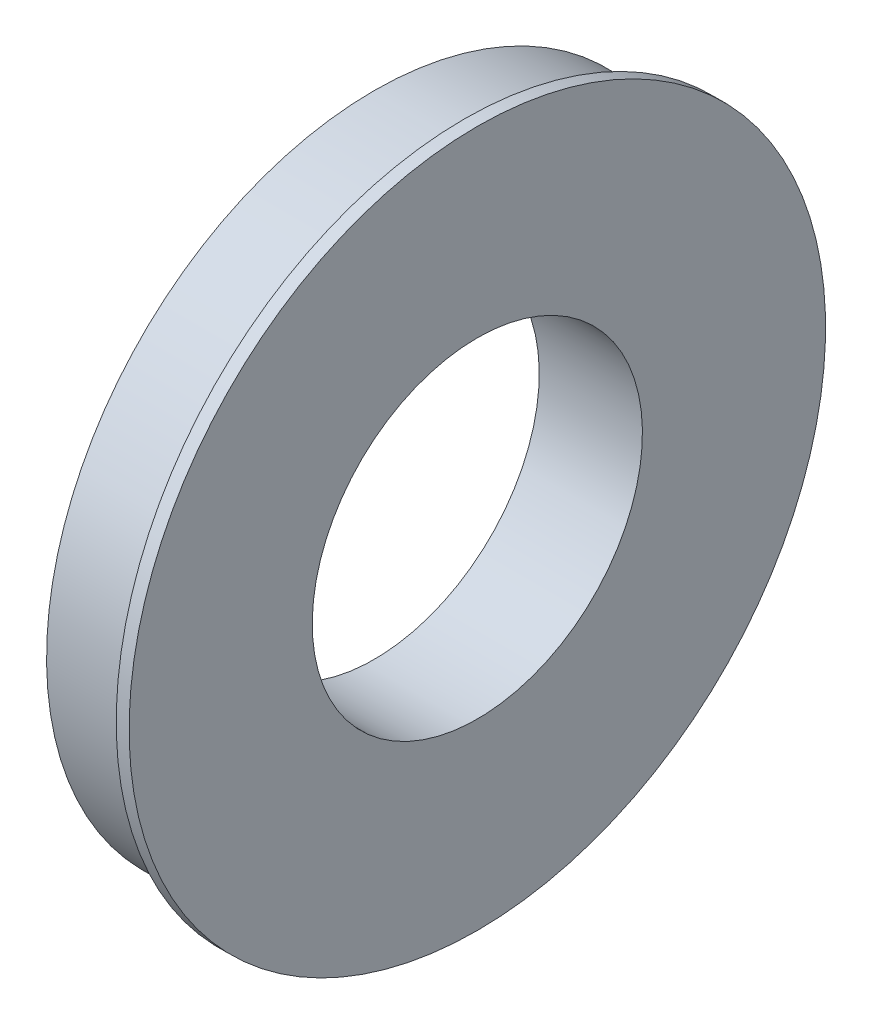
ISO-10303-21;
HEADER;
FILE_DESCRIPTION(('STEP AP214'),'2;1');
FILE_NAME('part.step','',(''),(''),'','','');
FILE_SCHEMA(('AUTOMOTIVE_DESIGN { 1 0 10303 214 1 1 1 1 }'));
ENDSEC;
DATA;
#1=APPLICATION_CONTEXT('core data for automotive mechanical design processes');
#2=APPLICATION_PROTOCOL_DEFINITION('international standard','automotive_design',2000,#1);
#3=PRODUCT_CONTEXT('',#1,'mechanical');
#4=PRODUCT('Part','Part','',(#3));
#5=PRODUCT_RELATED_PRODUCT_CATEGORY('part','',(#4));
#6=PRODUCT_DEFINITION_FORMATION('','',#4);
#7=PRODUCT_DEFINITION_CONTEXT('part definition',#1,'design');
#8=PRODUCT_DEFINITION('design','',#6,#7);
#9=PRODUCT_DEFINITION_SHAPE('','',#8);
#10=(LENGTH_UNIT() NAMED_UNIT(*) SI_UNIT(.MILLI.,.METRE.));
#11=(NAMED_UNIT(*) PLANE_ANGLE_UNIT() SI_UNIT($,.RADIAN.));
#12=(NAMED_UNIT(*) SI_UNIT($,.STERADIAN.) SOLID_ANGLE_UNIT());
#13=UNCERTAINTY_MEASURE_WITH_UNIT(LENGTH_MEASURE(1.E-05),#10,'distance_accuracy_value','');
#14=(GEOMETRIC_REPRESENTATION_CONTEXT(3) GLOBAL_UNCERTAINTY_ASSIGNED_CONTEXT((#13)) GLOBAL_UNIT_ASSIGNED_CONTEXT((#10,
#11,#12)) REPRESENTATION_CONTEXT('',''));
#15=CARTESIAN_POINT('',(0.,0.,0.));
#16=DIRECTION('',(0.,0.,1.));
#17=DIRECTION('',(1.,0.,0.));
#18=AXIS2_PLACEMENT_3D('',#15,#16,#17);
#19=CARTESIAN_POINT('',(0.,0.,0.));
#20=DIRECTION('',(-1.,0.,0.));
#21=DIRECTION('',(0.,-1.,0.));
#22=AXIS2_PLACEMENT_3D('',#19,#20,#21);
#23=PLANE('',#22);
#24=CARTESIAN_POINT('',(0.,0.,0.));
#25=DIRECTION('',(1.,0.,0.));
#26=DIRECTION('',(0.,1.,0.));
#27=AXIS2_PLACEMENT_3D('',#24,#25,#26);
#28=CIRCLE('',#27,32.);
#29=CARTESIAN_POINT('',(0.,32.,0.));
#30=VERTEX_POINT('',#29);
#31=EDGE_CURVE('E54',#30,#30,#28,.T.);
#32=ORIENTED_EDGE('',*,*,#31,.T.);
#33=EDGE_LOOP('',(#32));
#34=FACE_BOUND('',#33,.T.);
#35=CARTESIAN_POINT('',(0.,0.,0.));
#36=DIRECTION('',(1.,0.,0.));
#37=DIRECTION('',(0.,1.,0.));
#38=AXIS2_PLACEMENT_3D('',#35,#36,#37);
#39=CIRCLE('',#38,63.5);
#40=CARTESIAN_POINT('',(0.,63.5,0.));
#41=VERTEX_POINT('',#40);
#42=EDGE_CURVE('E10',#41,#41,#39,.T.);
#43=ORIENTED_EDGE('',*,*,#42,.F.);
#44=EDGE_LOOP('',(#43));
#45=FACE_BOUND('',#44,.T.);
#46=ADVANCED_FACE('F35',(#34,#45),#23,.T.);
#47=CARTESIAN_POINT('',(20.,0.,0.));
#48=DIRECTION('',(1.,0.,0.));
#49=DIRECTION('',(0.,1.,0.));
#50=AXIS2_PLACEMENT_3D('',#47,#48,#49);
#51=CYLINDRICAL_SURFACE('',#50,63.5);
#52=ORIENTED_EDGE('',*,*,#42,.T.);
#53=EDGE_LOOP('',(#52));
#54=FACE_BOUND('',#53,.T.);
#55=CARTESIAN_POINT('',(17.5,0.,0.));
#56=DIRECTION('',(1.,0.,0.));
#57=DIRECTION('',(0.,1.,0.));
#58=AXIS2_PLACEMENT_3D('',#55,#56,#57);
#59=CIRCLE('',#58,63.5);
#60=CARTESIAN_POINT('',(17.5,63.5,0.));
#61=VERTEX_POINT('',#60);
#62=EDGE_CURVE('E41',#61,#61,#59,.T.);
#63=ORIENTED_EDGE('',*,*,#62,.F.);
#64=EDGE_LOOP('',(#63));
#65=FACE_BOUND('',#64,.T.);
#66=ADVANCED_FACE('F83',(#54,#65),#51,.T.);
#67=CARTESIAN_POINT('',(17.5,63.5,0.));
#68=DIRECTION('',(-1.,0.,0.));
#69=DIRECTION('',(0.,-1.,0.));
#70=AXIS2_PLACEMENT_3D('',#67,#68,#69);
#71=PLANE('',#70);
#72=ORIENTED_EDGE('',*,*,#62,.T.);
#73=EDGE_LOOP('',(#72));
#74=FACE_BOUND('',#73,.T.);
#75=CARTESIAN_POINT('',(17.5,0.,0.));
#76=DIRECTION('',(1.,0.,0.));
#77=DIRECTION('',(0.,1.,0.));
#78=AXIS2_PLACEMENT_3D('',#75,#76,#77);
#79=CIRCLE('',#78,67.5);
#80=CARTESIAN_POINT('',(17.5,67.5,0.));
#81=VERTEX_POINT('',#80);
#82=EDGE_CURVE('E45',#81,#81,#79,.T.);
#83=ORIENTED_EDGE('',*,*,#82,.F.);
#84=EDGE_LOOP('',(#83));
#85=FACE_BOUND('',#84,.T.);
#86=ADVANCED_FACE('F77',(#74,#85),#71,.T.);
#87=CARTESIAN_POINT('',(20.,0.,0.));
#88=DIRECTION('',(1.,0.,0.));
#89=DIRECTION('',(0.,1.,0.));
#90=AXIS2_PLACEMENT_3D('',#87,#88,#89);
#91=CYLINDRICAL_SURFACE('',#90,67.5);
#92=ORIENTED_EDGE('',*,*,#82,.T.);
#93=EDGE_LOOP('',(#92));
#94=FACE_BOUND('',#93,.T.);
#95=CARTESIAN_POINT('',(20.,0.,0.));
#96=DIRECTION('',(1.,0.,0.));
#97=DIRECTION('',(0.,1.,0.));
#98=AXIS2_PLACEMENT_3D('',#95,#96,#97);
#99=CIRCLE('',#98,67.5);
#100=CARTESIAN_POINT('',(20.,67.5,0.));
#101=VERTEX_POINT('',#100);
#102=EDGE_CURVE('E49',#101,#101,#99,.T.);
#103=ORIENTED_EDGE('',*,*,#102,.F.);
#104=EDGE_LOOP('',(#103));
#105=FACE_BOUND('',#104,.T.);
#106=ADVANCED_FACE('F72',(#94,#105),#91,.T.);
#107=CARTESIAN_POINT('',(20.,67.5,0.));
#108=DIRECTION('',(1.,0.,0.));
#109=DIRECTION('',(0.,1.,0.));
#110=AXIS2_PLACEMENT_3D('',#107,#108,#109);
#111=PLANE('',#110);
#112=CARTESIAN_POINT('',(20.,0.,0.));
#113=DIRECTION('',(1.,0.,0.));
#114=DIRECTION('',(0.,1.,0.));
#115=AXIS2_PLACEMENT_3D('',#112,#113,#114);
#116=CIRCLE('',#115,32.);
#117=CARTESIAN_POINT('',(20.,32.,0.));
#118=VERTEX_POINT('',#117);
#119=EDGE_CURVE('E55',#118,#118,#116,.T.);
#120=ORIENTED_EDGE('',*,*,#119,.F.);
#121=EDGE_LOOP('',(#120));
#122=FACE_BOUND('',#121,.T.);
#123=ORIENTED_EDGE('',*,*,#102,.T.);
#124=EDGE_LOOP('',(#123));
#125=FACE_BOUND('',#124,.T.);
#126=ADVANCED_FACE('F66',(#122,#125),#111,.T.);
#127=CARTESIAN_POINT('',(0.,0.,0.));
#128=DIRECTION('',(1.,0.,0.));
#129=DIRECTION('',(0.,1.,0.));
#130=AXIS2_PLACEMENT_3D('',#127,#128,#129);
#131=CYLINDRICAL_SURFACE('',#130,32.);
#132=ORIENTED_EDGE('',*,*,#31,.F.);
#133=EDGE_LOOP('',(#132));
#134=FACE_BOUND('',#133,.T.);
#135=ORIENTED_EDGE('',*,*,#119,.T.);
#136=EDGE_LOOP('',(#135));
#137=FACE_BOUND('',#136,.T.);
#138=ADVANCED_FACE('F63',(#134,#137),#131,.F.);
#139=CLOSED_SHELL('',(#46,#66,#86,#106,#126,#138));
#140=MANIFOLD_SOLID_BREP('B2',#139);
#141=ADVANCED_BREP_SHAPE_REPRESENTATION('',(#18,#140),#14);
#142=SHAPE_DEFINITION_REPRESENTATION(#9,#141);
ENDSEC;
END-ISO-10303-21;
